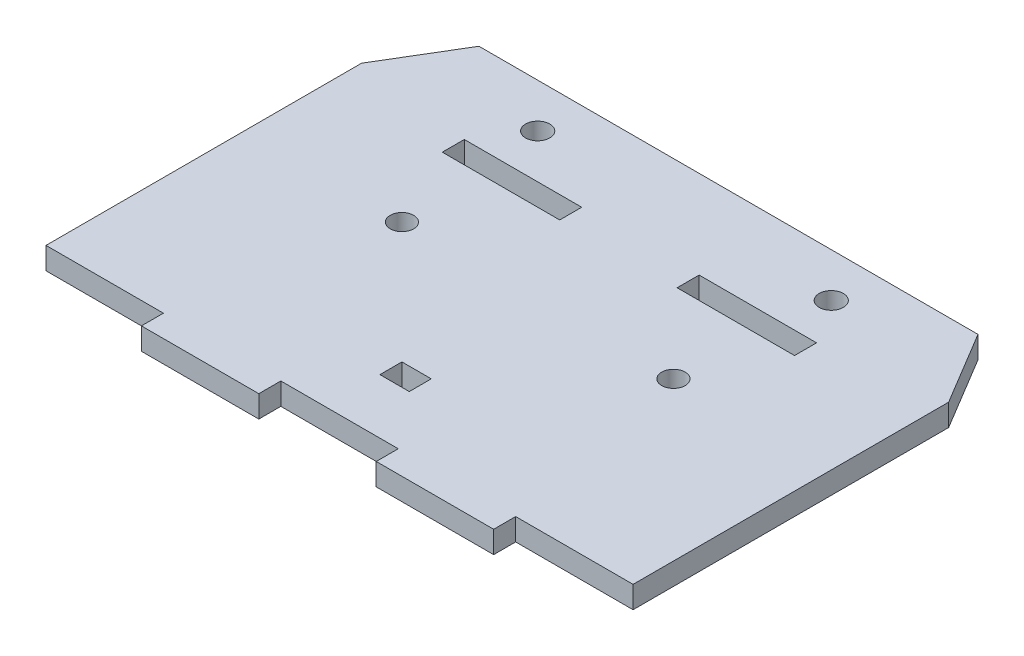
ISO-10303-21;
HEADER;
FILE_DESCRIPTION(('STEP AP214'),'2;1');
FILE_NAME('part.step','',(''),(''),'','','');
FILE_SCHEMA(('AUTOMOTIVE_DESIGN { 1 0 10303 214 1 1 1 1 }'));
ENDSEC;
DATA;
#1=APPLICATION_CONTEXT('core data for automotive mechanical design processes');
#2=APPLICATION_PROTOCOL_DEFINITION('international standard','automotive_design',2000,#1);
#3=PRODUCT_CONTEXT('',#1,'mechanical');
#4=PRODUCT('Part','Part','',(#3));
#5=PRODUCT_RELATED_PRODUCT_CATEGORY('part','',(#4));
#6=PRODUCT_DEFINITION_FORMATION('','',#4);
#7=PRODUCT_DEFINITION_CONTEXT('part definition',#1,'design');
#8=PRODUCT_DEFINITION('design','',#6,#7);
#9=PRODUCT_DEFINITION_SHAPE('','',#8);
#10=(LENGTH_UNIT() NAMED_UNIT(*) SI_UNIT(.MILLI.,.METRE.));
#11=(NAMED_UNIT(*) PLANE_ANGLE_UNIT() SI_UNIT($,.RADIAN.));
#12=(NAMED_UNIT(*) SI_UNIT($,.STERADIAN.) SOLID_ANGLE_UNIT());
#13=UNCERTAINTY_MEASURE_WITH_UNIT(LENGTH_MEASURE(1.E-05),#10,'distance_accuracy_value','');
#14=(GEOMETRIC_REPRESENTATION_CONTEXT(3) GLOBAL_UNCERTAINTY_ASSIGNED_CONTEXT((#13)) GLOBAL_UNIT_ASSIGNED_CONTEXT((#10,
#11,#12)) REPRESENTATION_CONTEXT('',''));
#15=CARTESIAN_POINT('',(0.,0.,0.));
#16=DIRECTION('',(0.,0.,1.));
#17=DIRECTION('',(1.,0.,0.));
#18=AXIS2_PLACEMENT_3D('',#15,#16,#17);
#19=CARTESIAN_POINT('',(0.,3.,0.));
#20=DIRECTION('',(0.,-1.,0.));
#21=DIRECTION('',(0.,0.,-1.));
#22=AXIS2_PLACEMENT_3D('',#19,#20,#21);
#23=PLANE('',#22);
#24=DIRECTION('',(-1.,0.,0.));
#25=VECTOR('',#24,1.);
#26=CARTESIAN_POINT('',(-2.,3.,-4.50000000000001));
#27=LINE('',#26,#25);
#28=CARTESIAN_POINT('',(2.,3.,-4.50000000000001));
#29=VERTEX_POINT('',#28);
#30=CARTESIAN_POINT('',(-2.,3.,-4.50000000000001));
#31=VERTEX_POINT('',#30);
#32=EDGE_CURVE('E236',#29,#31,#27,.T.);
#33=ORIENTED_EDGE('',*,*,#32,.F.);
#34=DIRECTION('',(0.,0.,-1.));
#35=VECTOR('',#34,1.);
#36=CARTESIAN_POINT('',(2.,3.,-4.50000000000001));
#37=LINE('',#36,#35);
#38=CARTESIAN_POINT('',(2.00000000000001,3.,-1.50000000000001));
#39=VERTEX_POINT('',#38);
#40=EDGE_CURVE('E48',#39,#29,#37,.T.);
#41=ORIENTED_EDGE('',*,*,#40,.F.);
#42=DIRECTION('',(1.,0.,0.));
#43=VECTOR('',#42,1.);
#44=CARTESIAN_POINT('',(-2.,3.,-1.50000000000001));
#45=LINE('',#44,#43);
#46=CARTESIAN_POINT('',(-2.,3.,-1.50000000000001));
#47=VERTEX_POINT('',#46);
#48=EDGE_CURVE('E227',#47,#39,#45,.T.);
#49=ORIENTED_EDGE('',*,*,#48,.F.);
#50=DIRECTION('',(0.,0.,1.));
#51=VECTOR('',#50,1.);
#52=CARTESIAN_POINT('',(-2.,3.,-4.50000000000001));
#53=LINE('',#52,#51);
#54=EDGE_CURVE('E230',#31,#47,#53,.T.);
#55=ORIENTED_EDGE('',*,*,#54,.F.);
#56=EDGE_LOOP('',(#33,#41,#49,#55));
#57=FACE_BOUND('',#56,.T.);
#58=CARTESIAN_POINT('',(-18.5,3.,-21.));
#59=DIRECTION('',(0.,1.,0.));
#60=DIRECTION('',(0.,0.,1.));
#61=AXIS2_PLACEMENT_3D('',#58,#59,#60);
#62=CIRCLE('',#61,1.6);
#63=CARTESIAN_POINT('',(-18.5,3.,-19.4));
#64=VERTEX_POINT('',#63);
#65=EDGE_CURVE('E249',#64,#64,#62,.T.);
#66=ORIENTED_EDGE('',*,*,#65,.F.);
#67=EDGE_LOOP('',(#66));
#68=FACE_BOUND('',#67,.T.);
#69=DIRECTION('',(-1.,0.,0.));
#70=VECTOR('',#69,1.);
#71=CARTESIAN_POINT('',(-8.00000000000001,3.,-35.));
#72=LINE('',#71,#70);
#73=CARTESIAN_POINT('',(-8.00000000000001,3.,-35.));
#74=VERTEX_POINT('',#73);
#75=CARTESIAN_POINT('',(-24.,3.,-35.));
#76=VERTEX_POINT('',#75);
#77=EDGE_CURVE('E268',#74,#76,#72,.T.);
#78=ORIENTED_EDGE('',*,*,#77,.F.);
#79=DIRECTION('',(0.,0.,-1.));
#80=VECTOR('',#79,1.);
#81=CARTESIAN_POINT('',(-8.00000000000001,3.,-32.));
#82=LINE('',#81,#80);
#83=CARTESIAN_POINT('',(-8.00000000000001,3.,-32.));
#84=VERTEX_POINT('',#83);
#85=EDGE_CURVE('E56',#84,#74,#82,.T.);
#86=ORIENTED_EDGE('',*,*,#85,.F.);
#87=DIRECTION('',(1.,0.,0.));
#88=VECTOR('',#87,1.);
#89=CARTESIAN_POINT('',(-24.,3.,-32.));
#90=LINE('',#89,#88);
#91=CARTESIAN_POINT('',(-24.,3.,-32.));
#92=VERTEX_POINT('',#91);
#93=EDGE_CURVE('E257',#92,#84,#90,.T.);
#94=ORIENTED_EDGE('',*,*,#93,.F.);
#95=DIRECTION('',(0.,0.,1.));
#96=VECTOR('',#95,1.);
#97=CARTESIAN_POINT('',(-24.,3.,-35.));
#98=LINE('',#97,#96);
#99=EDGE_CURVE('E272',#76,#92,#98,.T.);
#100=ORIENTED_EDGE('',*,*,#99,.F.);
#101=EDGE_LOOP('',(#78,#86,#94,#100));
#102=FACE_BOUND('',#101,.T.);
#103=CARTESIAN_POINT('',(18.5,3.,-21.));
#104=DIRECTION('',(0.,1.,0.));
#105=DIRECTION('',(0.,0.,1.));
#106=AXIS2_PLACEMENT_3D('',#103,#104,#105);
#107=CIRCLE('',#106,1.6);
#108=CARTESIAN_POINT('',(18.5,3.,-19.4));
#109=VERTEX_POINT('',#108);
#110=EDGE_CURVE('E285',#109,#109,#107,.T.);
#111=ORIENTED_EDGE('',*,*,#110,.F.);
#112=EDGE_LOOP('',(#111));
#113=FACE_BOUND('',#112,.T.);
#114=DIRECTION('',(0.,0.,-1.));
#115=VECTOR('',#114,1.);
#116=CARTESIAN_POINT('',(24.,3.,-35.));
#117=LINE('',#116,#115);
#118=CARTESIAN_POINT('',(24.,3.,-32.));
#119=VERTEX_POINT('',#118);
#120=CARTESIAN_POINT('',(24.,3.,-35.));
#121=VERTEX_POINT('',#120);
#122=EDGE_CURVE('E305',#119,#121,#117,.T.);
#123=ORIENTED_EDGE('',*,*,#122,.F.);
#124=DIRECTION('',(1.,0.,0.));
#125=VECTOR('',#124,1.);
#126=CARTESIAN_POINT('',(24.,3.,-32.));
#127=LINE('',#126,#125);
#128=CARTESIAN_POINT('',(7.99999999999999,3.,-32.));
#129=VERTEX_POINT('',#128);
#130=EDGE_CURVE('E303',#129,#119,#127,.T.);
#131=ORIENTED_EDGE('',*,*,#130,.F.);
#132=DIRECTION('',(0.,0.,1.));
#133=VECTOR('',#132,1.);
#134=CARTESIAN_POINT('',(7.99999999999999,3.,-32.));
#135=LINE('',#134,#133);
#136=CARTESIAN_POINT('',(7.99999999999999,3.,-35.));
#137=VERTEX_POINT('',#136);
#138=EDGE_CURVE('E293',#137,#129,#135,.T.);
#139=ORIENTED_EDGE('',*,*,#138,.F.);
#140=DIRECTION('',(-1.,0.,0.));
#141=VECTOR('',#140,1.);
#142=CARTESIAN_POINT('',(7.99999999999999,3.,-35.));
#143=LINE('',#142,#141);
#144=EDGE_CURVE('E308',#121,#137,#143,.T.);
#145=ORIENTED_EDGE('',*,*,#144,.F.);
#146=EDGE_LOOP('',(#123,#131,#139,#145));
#147=FACE_BOUND('',#146,.T.);
#148=DIRECTION('',(-1.,0.,0.));
#149=VECTOR('',#148,1.);
#150=CARTESIAN_POINT('',(-34.,3.,-47.));
#151=LINE('',#150,#149);
#152=CARTESIAN_POINT('',(34.,3.,-47.));
#153=VERTEX_POINT('',#152);
#154=CARTESIAN_POINT('',(-34.,3.,-47.));
#155=VERTEX_POINT('',#154);
#156=EDGE_CURVE('E332',#153,#155,#151,.T.);
#157=ORIENTED_EDGE('',*,*,#156,.T.);
#158=DIRECTION('',(-0.514495755427526,0.,0.857492925712544));
#159=VECTOR('',#158,1.);
#160=CARTESIAN_POINT('',(-40.,3.,-37.));
#161=LINE('',#160,#159);
#162=CARTESIAN_POINT('',(-40.,3.,-37.));
#163=VERTEX_POINT('',#162);
#164=EDGE_CURVE('E335',#155,#163,#161,.T.);
#165=ORIENTED_EDGE('',*,*,#164,.T.);
#166=DIRECTION('',(0.,0.,1.));
#167=VECTOR('',#166,1.);
#168=CARTESIAN_POINT('',(-40.,3.,-37.));
#169=LINE('',#168,#167);
#170=CARTESIAN_POINT('',(-40.,3.,6.));
#171=VERTEX_POINT('',#170);
#172=EDGE_CURVE('E338',#163,#171,#169,.T.);
#173=ORIENTED_EDGE('',*,*,#172,.T.);
#174=DIRECTION('',(1.,0.,0.));
#175=VECTOR('',#174,1.);
#176=CARTESIAN_POINT('',(-40.,3.,6.));
#177=LINE('',#176,#175);
#178=CARTESIAN_POINT('',(-24.,3.,6.));
#179=VERTEX_POINT('',#178);
#180=EDGE_CURVE('E340',#171,#179,#177,.T.);
#181=ORIENTED_EDGE('',*,*,#180,.T.);
#182=DIRECTION('',(0.,0.,1.));
#183=VECTOR('',#182,1.);
#184=CARTESIAN_POINT('',(-24.,3.,6.));
#185=LINE('',#184,#183);
#186=CARTESIAN_POINT('',(-24.,3.,9.));
#187=VERTEX_POINT('',#186);
#188=EDGE_CURVE('E342',#179,#187,#185,.T.);
#189=ORIENTED_EDGE('',*,*,#188,.T.);
#190=DIRECTION('',(1.,0.,0.));
#191=VECTOR('',#190,1.);
#192=CARTESIAN_POINT('',(-24.,3.,9.));
#193=LINE('',#192,#191);
#194=CARTESIAN_POINT('',(-8.,3.,8.99999999999999));
#195=VERTEX_POINT('',#194);
#196=EDGE_CURVE('E344',#187,#195,#193,.T.);
#197=ORIENTED_EDGE('',*,*,#196,.T.);
#198=DIRECTION('',(0.,0.,-1.));
#199=VECTOR('',#198,1.);
#200=CARTESIAN_POINT('',(-8.,3.,8.99999999999999));
#201=LINE('',#200,#199);
#202=CARTESIAN_POINT('',(-8.,3.,6.));
#203=VERTEX_POINT('',#202);
#204=EDGE_CURVE('E346',#195,#203,#201,.T.);
#205=ORIENTED_EDGE('',*,*,#204,.T.);
#206=DIRECTION('',(1.,0.,0.));
#207=VECTOR('',#206,1.);
#208=CARTESIAN_POINT('',(-8.,3.,6.));
#209=LINE('',#208,#207);
#210=CARTESIAN_POINT('',(8.,3.,6.));
#211=VERTEX_POINT('',#210);
#212=EDGE_CURVE('E348',#203,#211,#209,.T.);
#213=ORIENTED_EDGE('',*,*,#212,.T.);
#214=DIRECTION('',(0.,0.,1.));
#215=VECTOR('',#214,1.);
#216=CARTESIAN_POINT('',(8.,3.,6.));
#217=LINE('',#216,#215);
#218=CARTESIAN_POINT('',(8.,3.,9.));
#219=VERTEX_POINT('',#218);
#220=EDGE_CURVE('E350',#211,#219,#217,.T.);
#221=ORIENTED_EDGE('',*,*,#220,.T.);
#222=DIRECTION('',(1.,0.,0.));
#223=VECTOR('',#222,1.);
#224=CARTESIAN_POINT('',(8.,3.,9.));
#225=LINE('',#224,#223);
#226=CARTESIAN_POINT('',(24.,3.,8.99999999999999));
#227=VERTEX_POINT('',#226);
#228=EDGE_CURVE('E352',#219,#227,#225,.T.);
#229=ORIENTED_EDGE('',*,*,#228,.T.);
#230=DIRECTION('',(0.,0.,-1.));
#231=VECTOR('',#230,1.);
#232=CARTESIAN_POINT('',(24.,3.,8.99999999999999));
#233=LINE('',#232,#231);
#234=CARTESIAN_POINT('',(24.,3.,6.));
#235=VERTEX_POINT('',#234);
#236=EDGE_CURVE('E354',#227,#235,#233,.T.);
#237=ORIENTED_EDGE('',*,*,#236,.T.);
#238=DIRECTION('',(1.,0.,0.));
#239=VECTOR('',#238,1.);
#240=CARTESIAN_POINT('',(24.,3.,6.));
#241=LINE('',#240,#239);
#242=CARTESIAN_POINT('',(40.,3.,6.));
#243=VERTEX_POINT('',#242);
#244=EDGE_CURVE('E356',#235,#243,#241,.T.);
#245=ORIENTED_EDGE('',*,*,#244,.T.);
#246=DIRECTION('',(0.,0.,-1.));
#247=VECTOR('',#246,1.);
#248=CARTESIAN_POINT('',(40.,3.,-37.));
#249=LINE('',#248,#247);
#250=CARTESIAN_POINT('',(40.,3.,-37.));
#251=VERTEX_POINT('',#250);
#252=EDGE_CURVE('E358',#243,#251,#249,.T.);
#253=ORIENTED_EDGE('',*,*,#252,.T.);
#254=DIRECTION('',(-0.514495755427526,0.,-0.857492925712544));
#255=VECTOR('',#254,1.);
#256=CARTESIAN_POINT('',(34.,3.,-47.));
#257=LINE('',#256,#255);
#258=EDGE_CURVE('E360',#251,#153,#257,.T.);
#259=ORIENTED_EDGE('',*,*,#258,.T.);
#260=EDGE_LOOP('',(#157,#165,#173,#181,#189,#197,#205,#213,#221,#229,#237,#245,#253,#259));
#261=FACE_BOUND('',#260,.T.);
#262=CARTESIAN_POINT('',(-20.,3.,-41.));
#263=DIRECTION('',(0.,1.,0.));
#264=DIRECTION('',(0.,0.,1.));
#265=AXIS2_PLACEMENT_3D('',#262,#263,#264);
#266=CIRCLE('',#265,1.65);
#267=CARTESIAN_POINT('',(-20.,3.,-39.35));
#268=VERTEX_POINT('',#267);
#269=EDGE_CURVE('E326',#268,#268,#266,.T.);
#270=ORIENTED_EDGE('',*,*,#269,.F.);
#271=EDGE_LOOP('',(#270));
#272=FACE_BOUND('',#271,.T.);
#273=CARTESIAN_POINT('',(20.,3.,-41.0031036621103));
#274=DIRECTION('',(0.,1.,0.));
#275=DIRECTION('',(0.,0.,1.));
#276=AXIS2_PLACEMENT_3D('',#273,#274,#275);
#277=CIRCLE('',#276,1.65);
#278=CARTESIAN_POINT('',(20.,3.,-39.3531036621103));
#279=VERTEX_POINT('',#278);
#280=EDGE_CURVE('E320',#279,#279,#277,.T.);
#281=ORIENTED_EDGE('',*,*,#280,.F.);
#282=EDGE_LOOP('',(#281));
#283=FACE_BOUND('',#282,.T.);
#284=ADVANCED_FACE('F33',(#57,#68,#102,#113,#147,#261,#272,#283),#23,.F.);
#285=CARTESIAN_POINT('',(0.,0.,0.));
#286=DIRECTION('',(0.,-1.,0.));
#287=DIRECTION('',(0.,0.,-1.));
#288=AXIS2_PLACEMENT_3D('',#285,#286,#287);
#289=PLANE('',#288);
#290=DIRECTION('',(0.,0.,-1.));
#291=VECTOR('',#290,1.);
#292=CARTESIAN_POINT('',(2.,0.,-4.50000000000001));
#293=LINE('',#292,#291);
#294=CARTESIAN_POINT('',(2.00000000000001,0.,-1.50000000000001));
#295=VERTEX_POINT('',#294);
#296=CARTESIAN_POINT('',(2.,0.,-4.50000000000001));
#297=VERTEX_POINT('',#296);
#298=EDGE_CURVE('E208',#295,#297,#293,.T.);
#299=ORIENTED_EDGE('',*,*,#298,.T.);
#300=DIRECTION('',(-1.,0.,0.));
#301=VECTOR('',#300,1.);
#302=CARTESIAN_POINT('',(-2.,0.,-4.50000000000001));
#303=LINE('',#302,#301);
#304=CARTESIAN_POINT('',(-2.,0.,-4.50000000000001));
#305=VERTEX_POINT('',#304);
#306=EDGE_CURVE('E218',#297,#305,#303,.T.);
#307=ORIENTED_EDGE('',*,*,#306,.T.);
#308=DIRECTION('',(0.,0.,1.));
#309=VECTOR('',#308,1.);
#310=CARTESIAN_POINT('',(-2.,0.,-4.50000000000001));
#311=LINE('',#310,#309);
#312=CARTESIAN_POINT('',(-2.,0.,-1.50000000000001));
#313=VERTEX_POINT('',#312);
#314=EDGE_CURVE('E222',#305,#313,#311,.T.);
#315=ORIENTED_EDGE('',*,*,#314,.T.);
#316=DIRECTION('',(1.,0.,0.));
#317=VECTOR('',#316,1.);
#318=CARTESIAN_POINT('',(-2.,0.,-1.50000000000001));
#319=LINE('',#318,#317);
#320=EDGE_CURVE('E214',#313,#295,#319,.T.);
#321=ORIENTED_EDGE('',*,*,#320,.T.);
#322=EDGE_LOOP('',(#299,#307,#315,#321));
#323=FACE_BOUND('',#322,.T.);
#324=CARTESIAN_POINT('',(-18.5,0.,-21.));
#325=DIRECTION('',(0.,1.,0.));
#326=DIRECTION('',(0.,0.,1.));
#327=AXIS2_PLACEMENT_3D('',#324,#325,#326);
#328=CIRCLE('',#327,1.6);
#329=CARTESIAN_POINT('',(-18.5,0.,-19.4));
#330=VERTEX_POINT('',#329);
#331=EDGE_CURVE('E237',#330,#330,#328,.T.);
#332=ORIENTED_EDGE('',*,*,#331,.T.);
#333=EDGE_LOOP('',(#332));
#334=FACE_BOUND('',#333,.T.);
#335=DIRECTION('',(0.,0.,-1.));
#336=VECTOR('',#335,1.);
#337=CARTESIAN_POINT('',(-8.00000000000001,0.,-32.));
#338=LINE('',#337,#336);
#339=CARTESIAN_POINT('',(-8.00000000000001,0.,-32.));
#340=VERTEX_POINT('',#339);
#341=CARTESIAN_POINT('',(-8.00000000000001,0.,-35.));
#342=VERTEX_POINT('',#341);
#343=EDGE_CURVE('E253',#340,#342,#338,.T.);
#344=ORIENTED_EDGE('',*,*,#343,.T.);
#345=DIRECTION('',(-1.,0.,0.));
#346=VECTOR('',#345,1.);
#347=CARTESIAN_POINT('',(-8.00000000000001,0.,-35.));
#348=LINE('',#347,#346);
#349=CARTESIAN_POINT('',(-24.,0.,-35.));
#350=VERTEX_POINT('',#349);
#351=EDGE_CURVE('E256',#342,#350,#348,.T.);
#352=ORIENTED_EDGE('',*,*,#351,.T.);
#353=DIRECTION('',(0.,0.,1.));
#354=VECTOR('',#353,1.);
#355=CARTESIAN_POINT('',(-24.,0.,-35.));
#356=LINE('',#355,#354);
#357=CARTESIAN_POINT('',(-24.,0.,-32.));
#358=VERTEX_POINT('',#357);
#359=EDGE_CURVE('E260',#350,#358,#356,.T.);
#360=ORIENTED_EDGE('',*,*,#359,.T.);
#361=DIRECTION('',(1.,0.,0.));
#362=VECTOR('',#361,1.);
#363=CARTESIAN_POINT('',(-24.,0.,-32.));
#364=LINE('',#363,#362);
#365=EDGE_CURVE('E263',#358,#340,#364,.T.);
#366=ORIENTED_EDGE('',*,*,#365,.T.);
#367=EDGE_LOOP('',(#344,#352,#360,#366));
#368=FACE_BOUND('',#367,.T.);
#369=CARTESIAN_POINT('',(18.5,0.,-21.));
#370=DIRECTION('',(0.,1.,0.));
#371=DIRECTION('',(0.,0.,1.));
#372=AXIS2_PLACEMENT_3D('',#369,#370,#371);
#373=CIRCLE('',#372,1.6);
#374=CARTESIAN_POINT('',(18.5,0.,-19.4));
#375=VERTEX_POINT('',#374);
#376=EDGE_CURVE('E269',#375,#375,#373,.T.);
#377=ORIENTED_EDGE('',*,*,#376,.T.);
#378=EDGE_LOOP('',(#377));
#379=FACE_BOUND('',#378,.T.);
#380=DIRECTION('',(1.,0.,0.));
#381=VECTOR('',#380,1.);
#382=CARTESIAN_POINT('',(24.,0.,-32.));
#383=LINE('',#382,#381);
#384=CARTESIAN_POINT('',(7.99999999999999,0.,-32.));
#385=VERTEX_POINT('',#384);
#386=CARTESIAN_POINT('',(24.,0.,-32.));
#387=VERTEX_POINT('',#386);
#388=EDGE_CURVE('E289',#385,#387,#383,.T.);
#389=ORIENTED_EDGE('',*,*,#388,.T.);
#390=DIRECTION('',(0.,0.,-1.));
#391=VECTOR('',#390,1.);
#392=CARTESIAN_POINT('',(24.,0.,-35.));
#393=LINE('',#392,#391);
#394=CARTESIAN_POINT('',(24.,0.,-35.));
#395=VERTEX_POINT('',#394);
#396=EDGE_CURVE('E292',#387,#395,#393,.T.);
#397=ORIENTED_EDGE('',*,*,#396,.T.);
#398=DIRECTION('',(-1.,0.,0.));
#399=VECTOR('',#398,1.);
#400=CARTESIAN_POINT('',(7.99999999999999,0.,-35.));
#401=LINE('',#400,#399);
#402=CARTESIAN_POINT('',(7.99999999999999,0.,-35.));
#403=VERTEX_POINT('',#402);
#404=EDGE_CURVE('E296',#395,#403,#401,.T.);
#405=ORIENTED_EDGE('',*,*,#404,.T.);
#406=DIRECTION('',(0.,0.,1.));
#407=VECTOR('',#406,1.);
#408=CARTESIAN_POINT('',(7.99999999999999,0.,-32.));
#409=LINE('',#408,#407);
#410=EDGE_CURVE('E299',#403,#385,#409,.T.);
#411=ORIENTED_EDGE('',*,*,#410,.T.);
#412=EDGE_LOOP('',(#389,#397,#405,#411));
#413=FACE_BOUND('',#412,.T.);
#414=CARTESIAN_POINT('',(-20.,0.,-41.));
#415=DIRECTION('',(0.,1.,0.));
#416=DIRECTION('',(0.,0.,1.));
#417=AXIS2_PLACEMENT_3D('',#414,#415,#416);
#418=CIRCLE('',#417,1.65);
#419=CARTESIAN_POINT('',(-20.,0.,-39.35));
#420=VERTEX_POINT('',#419);
#421=EDGE_CURVE('E323',#420,#420,#418,.T.);
#422=ORIENTED_EDGE('',*,*,#421,.T.);
#423=EDGE_LOOP('',(#422));
#424=FACE_BOUND('',#423,.T.);
#425=DIRECTION('',(-1.,0.,0.));
#426=VECTOR('',#425,1.);
#427=CARTESIAN_POINT('',(-34.,0.,-47.));
#428=LINE('',#427,#426);
#429=CARTESIAN_POINT('',(34.,0.,-47.));
#430=VERTEX_POINT('',#429);
#431=CARTESIAN_POINT('',(-34.,0.,-47.));
#432=VERTEX_POINT('',#431);
#433=EDGE_CURVE('E329',#430,#432,#428,.T.);
#434=ORIENTED_EDGE('',*,*,#433,.F.);
#435=DIRECTION('',(-0.514495755427526,0.,-0.857492925712544));
#436=VECTOR('',#435,1.);
#437=CARTESIAN_POINT('',(34.,0.,-47.));
#438=LINE('',#437,#436);
#439=CARTESIAN_POINT('',(40.,0.,-37.));
#440=VERTEX_POINT('',#439);
#441=EDGE_CURVE('E336',#440,#430,#438,.T.);
#442=ORIENTED_EDGE('',*,*,#441,.F.);
#443=DIRECTION('',(0.,0.,-1.));
#444=VECTOR('',#443,1.);
#445=CARTESIAN_POINT('',(40.,0.,-37.));
#446=LINE('',#445,#444);
#447=CARTESIAN_POINT('',(40.,0.,6.));
#448=VERTEX_POINT('',#447);
#449=EDGE_CURVE('E387',#448,#440,#446,.T.);
#450=ORIENTED_EDGE('',*,*,#449,.F.);
#451=DIRECTION('',(1.,0.,0.));
#452=VECTOR('',#451,1.);
#453=CARTESIAN_POINT('',(24.,0.,6.));
#454=LINE('',#453,#452);
#455=CARTESIAN_POINT('',(24.,0.,6.));
#456=VERTEX_POINT('',#455);
#457=EDGE_CURVE('E385',#456,#448,#454,.T.);
#458=ORIENTED_EDGE('',*,*,#457,.F.);
#459=DIRECTION('',(0.,0.,-1.));
#460=VECTOR('',#459,1.);
#461=CARTESIAN_POINT('',(24.,0.,8.99999999999999));
#462=LINE('',#461,#460);
#463=CARTESIAN_POINT('',(24.,0.,8.99999999999999));
#464=VERTEX_POINT('',#463);
#465=EDGE_CURVE('E383',#464,#456,#462,.T.);
#466=ORIENTED_EDGE('',*,*,#465,.F.);
#467=DIRECTION('',(1.,0.,0.));
#468=VECTOR('',#467,1.);
#469=CARTESIAN_POINT('',(8.,0.,9.));
#470=LINE('',#469,#468);
#471=CARTESIAN_POINT('',(8.,0.,9.));
#472=VERTEX_POINT('',#471);
#473=EDGE_CURVE('E381',#472,#464,#470,.T.);
#474=ORIENTED_EDGE('',*,*,#473,.F.);
#475=DIRECTION('',(0.,0.,1.));
#476=VECTOR('',#475,1.);
#477=CARTESIAN_POINT('',(8.,0.,6.));
#478=LINE('',#477,#476);
#479=CARTESIAN_POINT('',(8.,0.,6.));
#480=VERTEX_POINT('',#479);
#481=EDGE_CURVE('E379',#480,#472,#478,.T.);
#482=ORIENTED_EDGE('',*,*,#481,.F.);
#483=DIRECTION('',(1.,0.,0.));
#484=VECTOR('',#483,1.);
#485=CARTESIAN_POINT('',(-8.,0.,6.));
#486=LINE('',#485,#484);
#487=CARTESIAN_POINT('',(-8.,0.,6.));
#488=VERTEX_POINT('',#487);
#489=EDGE_CURVE('E377',#488,#480,#486,.T.);
#490=ORIENTED_EDGE('',*,*,#489,.F.);
#491=DIRECTION('',(0.,0.,-1.));
#492=VECTOR('',#491,1.);
#493=CARTESIAN_POINT('',(-8.,0.,8.99999999999999));
#494=LINE('',#493,#492);
#495=CARTESIAN_POINT('',(-8.,0.,8.99999999999999));
#496=VERTEX_POINT('',#495);
#497=EDGE_CURVE('E375',#496,#488,#494,.T.);
#498=ORIENTED_EDGE('',*,*,#497,.F.);
#499=DIRECTION('',(1.,0.,0.));
#500=VECTOR('',#499,1.);
#501=CARTESIAN_POINT('',(-24.,0.,9.));
#502=LINE('',#501,#500);
#503=CARTESIAN_POINT('',(-24.,0.,9.));
#504=VERTEX_POINT('',#503);
#505=EDGE_CURVE('E373',#504,#496,#502,.T.);
#506=ORIENTED_EDGE('',*,*,#505,.F.);
#507=DIRECTION('',(0.,0.,1.));
#508=VECTOR('',#507,1.);
#509=CARTESIAN_POINT('',(-24.,0.,6.));
#510=LINE('',#509,#508);
#511=CARTESIAN_POINT('',(-24.,0.,6.));
#512=VERTEX_POINT('',#511);
#513=EDGE_CURVE('E371',#512,#504,#510,.T.);
#514=ORIENTED_EDGE('',*,*,#513,.F.);
#515=DIRECTION('',(1.,0.,0.));
#516=VECTOR('',#515,1.);
#517=CARTESIAN_POINT('',(-40.,0.,6.));
#518=LINE('',#517,#516);
#519=CARTESIAN_POINT('',(-40.,0.,6.));
#520=VERTEX_POINT('',#519);
#521=EDGE_CURVE('E369',#520,#512,#518,.T.);
#522=ORIENTED_EDGE('',*,*,#521,.F.);
#523=DIRECTION('',(0.,0.,1.));
#524=VECTOR('',#523,1.);
#525=CARTESIAN_POINT('',(-40.,0.,-37.));
#526=LINE('',#525,#524);
#527=CARTESIAN_POINT('',(-40.,0.,-37.));
#528=VERTEX_POINT('',#527);
#529=EDGE_CURVE('E367',#528,#520,#526,.T.);
#530=ORIENTED_EDGE('',*,*,#529,.F.);
#531=DIRECTION('',(-0.514495755427526,0.,0.857492925712544));
#532=VECTOR('',#531,1.);
#533=CARTESIAN_POINT('',(-40.,0.,-37.));
#534=LINE('',#533,#532);
#535=EDGE_CURVE('E365',#432,#528,#534,.T.);
#536=ORIENTED_EDGE('',*,*,#535,.F.);
#537=EDGE_LOOP('',(#434,#442,#450,#458,#466,#474,#482,#490,#498,#506,#514,#522,#530,#536));
#538=FACE_BOUND('',#537,.T.);
#539=CARTESIAN_POINT('',(20.,0.,-41.0031036621103));
#540=DIRECTION('',(0.,1.,0.));
#541=DIRECTION('',(0.,0.,1.));
#542=AXIS2_PLACEMENT_3D('',#539,#540,#541);
#543=CIRCLE('',#542,1.65);
#544=CARTESIAN_POINT('',(20.,0.,-39.3531036621103));
#545=VERTEX_POINT('',#544);
#546=EDGE_CURVE('E243',#545,#545,#543,.T.);
#547=ORIENTED_EDGE('',*,*,#546,.T.);
#548=EDGE_LOOP('',(#547));
#549=FACE_BOUND('',#548,.T.);
#550=ADVANCED_FACE('F224',(#323,#334,#368,#379,#413,#424,#538,#549),#289,.T.);
#551=CARTESIAN_POINT('',(-34.,3.,-47.));
#552=DIRECTION('',(0.,0.,1.));
#553=DIRECTION('',(1.,0.,0.));
#554=AXIS2_PLACEMENT_3D('',#551,#552,#553);
#555=PLANE('',#554);
#556=ORIENTED_EDGE('',*,*,#433,.T.);
#557=DIRECTION('',(0.,-1.,0.));
#558=VECTOR('',#557,1.);
#559=CARTESIAN_POINT('',(-34.,3.,-47.));
#560=LINE('',#559,#558);
#561=EDGE_CURVE('E11',#155,#432,#560,.T.);
#562=ORIENTED_EDGE('',*,*,#561,.F.);
#563=ORIENTED_EDGE('',*,*,#156,.F.);
#564=DIRECTION('',(0.,-1.,0.));
#565=VECTOR('',#564,1.);
#566=CARTESIAN_POINT('',(34.,3.,-47.));
#567=LINE('',#566,#565);
#568=EDGE_CURVE('E362',#153,#430,#567,.T.);
#569=ORIENTED_EDGE('',*,*,#568,.T.);
#570=EDGE_LOOP('',(#556,#562,#563,#569));
#571=FACE_BOUND('',#570,.T.);
#572=ADVANCED_FACE('F35',(#571),#555,.F.);
#573=CARTESIAN_POINT('',(-40.,3.,-37.));
#574=DIRECTION('',(0.857492925712545,0.,0.514495755427526));
#575=DIRECTION('',(0.514495755427526,0.,-0.857492925712545));
#576=AXIS2_PLACEMENT_3D('',#573,#574,#575);
#577=PLANE('',#576);
#578=ORIENTED_EDGE('',*,*,#535,.T.);
#579=DIRECTION('',(0.,-1.,0.));
#580=VECTOR('',#579,1.);
#581=CARTESIAN_POINT('',(-40.,3.,-37.));
#582=LINE('',#581,#580);
#583=EDGE_CURVE('E41',#163,#528,#582,.T.);
#584=ORIENTED_EDGE('',*,*,#583,.F.);
#585=ORIENTED_EDGE('',*,*,#164,.F.);
#586=ORIENTED_EDGE('',*,*,#561,.T.);
#587=EDGE_LOOP('',(#578,#584,#585,#586));
#588=FACE_BOUND('',#587,.T.);
#589=ADVANCED_FACE('F452',(#588),#577,.F.);
#590=CARTESIAN_POINT('',(-40.,3.,-37.));
#591=DIRECTION('',(1.,0.,0.));
#592=DIRECTION('',(0.,0.,-1.));
#593=AXIS2_PLACEMENT_3D('',#590,#591,#592);
#594=PLANE('',#593);
#595=ORIENTED_EDGE('',*,*,#529,.T.);
#596=DIRECTION('',(0.,-1.,0.));
#597=VECTOR('',#596,1.);
#598=CARTESIAN_POINT('',(-40.,3.,6.));
#599=LINE('',#598,#597);
#600=EDGE_CURVE('E422',#171,#520,#599,.T.);
#601=ORIENTED_EDGE('',*,*,#600,.F.);
#602=ORIENTED_EDGE('',*,*,#172,.F.);
#603=ORIENTED_EDGE('',*,*,#583,.T.);
#604=EDGE_LOOP('',(#595,#601,#602,#603));
#605=FACE_BOUND('',#604,.T.);
#606=ADVANCED_FACE('F429',(#605),#594,.F.);
#607=CARTESIAN_POINT('',(-40.,3.,6.));
#608=DIRECTION('',(0.,0.,-1.));
#609=DIRECTION('',(-1.,0.,0.));
#610=AXIS2_PLACEMENT_3D('',#607,#608,#609);
#611=PLANE('',#610);
#612=ORIENTED_EDGE('',*,*,#521,.T.);
#613=DIRECTION('',(0.,-1.,0.));
#614=VECTOR('',#613,1.);
#615=CARTESIAN_POINT('',(-24.,3.,6.));
#616=LINE('',#615,#614);
#617=EDGE_CURVE('E419',#179,#512,#616,.T.);
#618=ORIENTED_EDGE('',*,*,#617,.F.);
#619=ORIENTED_EDGE('',*,*,#180,.F.);
#620=ORIENTED_EDGE('',*,*,#600,.T.);
#621=EDGE_LOOP('',(#612,#618,#619,#620));
#622=FACE_BOUND('',#621,.T.);
#623=ADVANCED_FACE('F440',(#622),#611,.F.);
#624=CARTESIAN_POINT('',(-24.,3.,6.));
#625=DIRECTION('',(1.,0.,0.));
#626=DIRECTION('',(0.,0.,-1.));
#627=AXIS2_PLACEMENT_3D('',#624,#625,#626);
#628=PLANE('',#627);
#629=ORIENTED_EDGE('',*,*,#513,.T.);
#630=DIRECTION('',(0.,-1.,0.));
#631=VECTOR('',#630,1.);
#632=CARTESIAN_POINT('',(-24.,3.,9.));
#633=LINE('',#632,#631);
#634=EDGE_CURVE('E416',#187,#504,#633,.T.);
#635=ORIENTED_EDGE('',*,*,#634,.F.);
#636=ORIENTED_EDGE('',*,*,#188,.F.);
#637=ORIENTED_EDGE('',*,*,#617,.T.);
#638=EDGE_LOOP('',(#629,#635,#636,#637));
#639=FACE_BOUND('',#638,.T.);
#640=ADVANCED_FACE('F444',(#639),#628,.F.);
#641=CARTESIAN_POINT('',(-24.,3.,9.));
#642=DIRECTION('',(0.,0.,-1.));
#643=DIRECTION('',(-1.,0.,0.));
#644=AXIS2_PLACEMENT_3D('',#641,#642,#643);
#645=PLANE('',#644);
#646=ORIENTED_EDGE('',*,*,#505,.T.);
#647=DIRECTION('',(0.,-1.,0.));
#648=VECTOR('',#647,1.);
#649=CARTESIAN_POINT('',(-8.,3.,8.99999999999999));
#650=LINE('',#649,#648);
#651=EDGE_CURVE('E413',#195,#496,#650,.T.);
#652=ORIENTED_EDGE('',*,*,#651,.F.);
#653=ORIENTED_EDGE('',*,*,#196,.F.);
#654=ORIENTED_EDGE('',*,*,#634,.T.);
#655=EDGE_LOOP('',(#646,#652,#653,#654));
#656=FACE_BOUND('',#655,.T.);
#657=ADVANCED_FACE('F495',(#656),#645,.F.);
#658=CARTESIAN_POINT('',(-8.,3.,8.99999999999999));
#659=DIRECTION('',(-1.,0.,0.));
#660=DIRECTION('',(0.,0.,1.));
#661=AXIS2_PLACEMENT_3D('',#658,#659,#660);
#662=PLANE('',#661);
#663=ORIENTED_EDGE('',*,*,#497,.T.);
#664=DIRECTION('',(0.,-1.,0.));
#665=VECTOR('',#664,1.);
#666=CARTESIAN_POINT('',(-8.,3.,6.));
#667=LINE('',#666,#665);
#668=EDGE_CURVE('E410',#203,#488,#667,.T.);
#669=ORIENTED_EDGE('',*,*,#668,.F.);
#670=ORIENTED_EDGE('',*,*,#204,.F.);
#671=ORIENTED_EDGE('',*,*,#651,.T.);
#672=EDGE_LOOP('',(#663,#669,#670,#671));
#673=FACE_BOUND('',#672,.T.);
#674=ADVANCED_FACE('F493',(#673),#662,.F.);
#675=CARTESIAN_POINT('',(-8.,3.,6.));
#676=DIRECTION('',(0.,0.,-1.));
#677=DIRECTION('',(-1.,0.,0.));
#678=AXIS2_PLACEMENT_3D('',#675,#676,#677);
#679=PLANE('',#678);
#680=ORIENTED_EDGE('',*,*,#489,.T.);
#681=DIRECTION('',(0.,-1.,0.));
#682=VECTOR('',#681,1.);
#683=CARTESIAN_POINT('',(8.,3.,6.));
#684=LINE('',#683,#682);
#685=EDGE_CURVE('E407',#211,#480,#684,.T.);
#686=ORIENTED_EDGE('',*,*,#685,.F.);
#687=ORIENTED_EDGE('',*,*,#212,.F.);
#688=ORIENTED_EDGE('',*,*,#668,.T.);
#689=EDGE_LOOP('',(#680,#686,#687,#688));
#690=FACE_BOUND('',#689,.T.);
#691=ADVANCED_FACE('F488',(#690),#679,.F.);
#692=CARTESIAN_POINT('',(8.,3.,6.));
#693=DIRECTION('',(1.,0.,0.));
#694=DIRECTION('',(0.,0.,-1.));
#695=AXIS2_PLACEMENT_3D('',#692,#693,#694);
#696=PLANE('',#695);
#697=ORIENTED_EDGE('',*,*,#481,.T.);
#698=DIRECTION('',(0.,-1.,0.));
#699=VECTOR('',#698,1.);
#700=CARTESIAN_POINT('',(8.,3.,9.));
#701=LINE('',#700,#699);
#702=EDGE_CURVE('E404',#219,#472,#701,.T.);
#703=ORIENTED_EDGE('',*,*,#702,.F.);
#704=ORIENTED_EDGE('',*,*,#220,.F.);
#705=ORIENTED_EDGE('',*,*,#685,.T.);
#706=EDGE_LOOP('',(#697,#703,#704,#705));
#707=FACE_BOUND('',#706,.T.);
#708=ADVANCED_FACE('F483',(#707),#696,.F.);
#709=CARTESIAN_POINT('',(8.,3.,9.));
#710=DIRECTION('',(0.,0.,-1.));
#711=DIRECTION('',(-1.,0.,0.));
#712=AXIS2_PLACEMENT_3D('',#709,#710,#711);
#713=PLANE('',#712);
#714=ORIENTED_EDGE('',*,*,#473,.T.);
#715=DIRECTION('',(0.,-1.,0.));
#716=VECTOR('',#715,1.);
#717=CARTESIAN_POINT('',(24.,3.,8.99999999999999));
#718=LINE('',#717,#716);
#719=EDGE_CURVE('E401',#227,#464,#718,.T.);
#720=ORIENTED_EDGE('',*,*,#719,.F.);
#721=ORIENTED_EDGE('',*,*,#228,.F.);
#722=ORIENTED_EDGE('',*,*,#702,.T.);
#723=EDGE_LOOP('',(#714,#720,#721,#722));
#724=FACE_BOUND('',#723,.T.);
#725=ADVANCED_FACE('F479',(#724),#713,.F.);
#726=CARTESIAN_POINT('',(24.,3.,8.99999999999999));
#727=DIRECTION('',(-1.,0.,0.));
#728=DIRECTION('',(0.,0.,1.));
#729=AXIS2_PLACEMENT_3D('',#726,#727,#728);
#730=PLANE('',#729);
#731=ORIENTED_EDGE('',*,*,#465,.T.);
#732=DIRECTION('',(0.,-1.,0.));
#733=VECTOR('',#732,1.);
#734=CARTESIAN_POINT('',(24.,3.,6.));
#735=LINE('',#734,#733);
#736=EDGE_CURVE('E398',#235,#456,#735,.T.);
#737=ORIENTED_EDGE('',*,*,#736,.F.);
#738=ORIENTED_EDGE('',*,*,#236,.F.);
#739=ORIENTED_EDGE('',*,*,#719,.T.);
#740=EDGE_LOOP('',(#731,#737,#738,#739));
#741=FACE_BOUND('',#740,.T.);
#742=ADVANCED_FACE('F474',(#741),#730,.F.);
#743=CARTESIAN_POINT('',(24.,3.,6.));
#744=DIRECTION('',(0.,0.,-1.));
#745=DIRECTION('',(-1.,0.,0.));
#746=AXIS2_PLACEMENT_3D('',#743,#744,#745);
#747=PLANE('',#746);
#748=ORIENTED_EDGE('',*,*,#457,.T.);
#749=DIRECTION('',(0.,-1.,0.));
#750=VECTOR('',#749,1.);
#751=CARTESIAN_POINT('',(40.,3.,6.));
#752=LINE('',#751,#750);
#753=EDGE_CURVE('E395',#243,#448,#752,.T.);
#754=ORIENTED_EDGE('',*,*,#753,.F.);
#755=ORIENTED_EDGE('',*,*,#244,.F.);
#756=ORIENTED_EDGE('',*,*,#736,.T.);
#757=EDGE_LOOP('',(#748,#754,#755,#756));
#758=FACE_BOUND('',#757,.T.);
#759=ADVANCED_FACE('F468',(#758),#747,.F.);
#760=CARTESIAN_POINT('',(40.,3.,-37.));
#761=DIRECTION('',(-1.,0.,0.));
#762=DIRECTION('',(0.,0.,1.));
#763=AXIS2_PLACEMENT_3D('',#760,#761,#762);
#764=PLANE('',#763);
#765=ORIENTED_EDGE('',*,*,#449,.T.);
#766=DIRECTION('',(0.,-1.,0.));
#767=VECTOR('',#766,1.);
#768=CARTESIAN_POINT('',(40.,3.,-37.));
#769=LINE('',#768,#767);
#770=EDGE_CURVE('E392',#251,#440,#769,.T.);
#771=ORIENTED_EDGE('',*,*,#770,.F.);
#772=ORIENTED_EDGE('',*,*,#252,.F.);
#773=ORIENTED_EDGE('',*,*,#753,.T.);
#774=EDGE_LOOP('',(#765,#771,#772,#773));
#775=FACE_BOUND('',#774,.T.);
#776=ADVANCED_FACE('F464',(#775),#764,.F.);
#777=CARTESIAN_POINT('',(34.,3.,-47.));
#778=DIRECTION('',(-0.857492925712545,0.,0.514495755427526));
#779=DIRECTION('',(0.514495755427526,0.,0.857492925712545));
#780=AXIS2_PLACEMENT_3D('',#777,#778,#779);
#781=PLANE('',#780);
#782=ORIENTED_EDGE('',*,*,#441,.T.);
#783=ORIENTED_EDGE('',*,*,#568,.F.);
#784=ORIENTED_EDGE('',*,*,#258,.F.);
#785=ORIENTED_EDGE('',*,*,#770,.T.);
#786=EDGE_LOOP('',(#782,#783,#784,#785));
#787=FACE_BOUND('',#786,.T.);
#788=ADVANCED_FACE('F459',(#787),#781,.F.);
#789=CARTESIAN_POINT('',(-20.,3.,-41.));
#790=DIRECTION('',(0.,-1.,0.));
#791=DIRECTION('',(0.,0.,-1.));
#792=AXIS2_PLACEMENT_3D('',#789,#790,#791);
#793=CYLINDRICAL_SURFACE('',#792,1.65);
#794=ORIENTED_EDGE('',*,*,#269,.T.);
#795=EDGE_LOOP('',(#794));
#796=FACE_BOUND('',#795,.T.);
#797=ORIENTED_EDGE('',*,*,#421,.F.);
#798=EDGE_LOOP('',(#797));
#799=FACE_BOUND('',#798,.T.);
#800=ADVANCED_FACE('F513',(#796,#799),#793,.F.);
#801=CARTESIAN_POINT('',(20.,3.,-41.0031036621103));
#802=DIRECTION('',(0.,-1.,0.));
#803=DIRECTION('',(0.,0.,-1.));
#804=AXIS2_PLACEMENT_3D('',#801,#802,#803);
#805=CYLINDRICAL_SURFACE('',#804,1.65);
#806=ORIENTED_EDGE('',*,*,#280,.T.);
#807=EDGE_LOOP('',(#806));
#808=FACE_BOUND('',#807,.T.);
#809=ORIENTED_EDGE('',*,*,#546,.F.);
#810=EDGE_LOOP('',(#809));
#811=FACE_BOUND('',#810,.T.);
#812=ADVANCED_FACE('F563',(#808,#811),#805,.F.);
#813=CARTESIAN_POINT('',(24.,0.,-32.));
#814=DIRECTION('',(0.,0.,1.));
#815=DIRECTION('',(1.,0.,0.));
#816=AXIS2_PLACEMENT_3D('',#813,#814,#815);
#817=PLANE('',#816);
#818=ORIENTED_EDGE('',*,*,#130,.T.);
#819=DIRECTION('',(0.,1.,0.));
#820=VECTOR('',#819,1.);
#821=CARTESIAN_POINT('',(24.,0.,-32.));
#822=LINE('',#821,#820);
#823=EDGE_CURVE('E302',#387,#119,#822,.T.);
#824=ORIENTED_EDGE('',*,*,#823,.F.);
#825=ORIENTED_EDGE('',*,*,#388,.F.);
#826=DIRECTION('',(0.,1.,0.));
#827=VECTOR('',#826,1.);
#828=CARTESIAN_POINT('',(7.99999999999999,0.,-32.));
#829=LINE('',#828,#827);
#830=EDGE_CURVE('E288',#385,#129,#829,.T.);
#831=ORIENTED_EDGE('',*,*,#830,.T.);
#832=EDGE_LOOP('',(#818,#824,#825,#831));
#833=FACE_BOUND('',#832,.T.);
#834=ADVANCED_FACE('F570',(#833),#817,.F.);
#835=CARTESIAN_POINT('',(7.99999999999999,0.,-32.));
#836=DIRECTION('',(-1.,0.,0.));
#837=DIRECTION('',(0.,0.,1.));
#838=AXIS2_PLACEMENT_3D('',#835,#836,#837);
#839=PLANE('',#838);
#840=ORIENTED_EDGE('',*,*,#138,.T.);
#841=ORIENTED_EDGE('',*,*,#830,.F.);
#842=ORIENTED_EDGE('',*,*,#410,.F.);
#843=DIRECTION('',(0.,1.,0.));
#844=VECTOR('',#843,1.);
#845=CARTESIAN_POINT('',(7.99999999999999,0.,-35.));
#846=LINE('',#845,#844);
#847=EDGE_CURVE('E314',#403,#137,#846,.T.);
#848=ORIENTED_EDGE('',*,*,#847,.T.);
#849=EDGE_LOOP('',(#840,#841,#842,#848));
#850=FACE_BOUND('',#849,.T.);
#851=ADVANCED_FACE('F577',(#850),#839,.F.);
#852=CARTESIAN_POINT('',(7.99999999999999,0.,-35.));
#853=DIRECTION('',(0.,0.,-1.));
#854=DIRECTION('',(-1.,0.,0.));
#855=AXIS2_PLACEMENT_3D('',#852,#853,#854);
#856=PLANE('',#855);
#857=ORIENTED_EDGE('',*,*,#144,.T.);
#858=ORIENTED_EDGE('',*,*,#847,.F.);
#859=ORIENTED_EDGE('',*,*,#404,.F.);
#860=DIRECTION('',(0.,1.,0.));
#861=VECTOR('',#860,1.);
#862=CARTESIAN_POINT('',(24.,0.,-35.));
#863=LINE('',#862,#861);
#864=EDGE_CURVE('E316',#395,#121,#863,.T.);
#865=ORIENTED_EDGE('',*,*,#864,.T.);
#866=EDGE_LOOP('',(#857,#858,#859,#865));
#867=FACE_BOUND('',#866,.T.);
#868=ADVANCED_FACE('F586',(#867),#856,.F.);
#869=CARTESIAN_POINT('',(24.,0.,-35.));
#870=DIRECTION('',(1.,0.,0.));
#871=DIRECTION('',(0.,0.,-1.));
#872=AXIS2_PLACEMENT_3D('',#869,#870,#871);
#873=PLANE('',#872);
#874=ORIENTED_EDGE('',*,*,#122,.T.);
#875=ORIENTED_EDGE('',*,*,#864,.F.);
#876=ORIENTED_EDGE('',*,*,#396,.F.);
#877=ORIENTED_EDGE('',*,*,#823,.T.);
#878=EDGE_LOOP('',(#874,#875,#876,#877));
#879=FACE_BOUND('',#878,.T.);
#880=ADVANCED_FACE('F594',(#879),#873,.F.);
#881=CARTESIAN_POINT('',(18.5,0.,-21.));
#882=DIRECTION('',(0.,1.,0.));
#883=DIRECTION('',(0.,0.,1.));
#884=AXIS2_PLACEMENT_3D('',#881,#882,#883);
#885=CYLINDRICAL_SURFACE('',#884,1.6);
#886=ORIENTED_EDGE('',*,*,#376,.F.);
#887=EDGE_LOOP('',(#886));
#888=FACE_BOUND('',#887,.T.);
#889=ORIENTED_EDGE('',*,*,#110,.T.);
#890=EDGE_LOOP('',(#889));
#891=FACE_BOUND('',#890,.T.);
#892=ADVANCED_FACE('F602',(#888,#891),#885,.F.);
#893=CARTESIAN_POINT('',(-8.00000000000001,0.,-32.));
#894=DIRECTION('',(1.,0.,0.));
#895=DIRECTION('',(0.,0.,-1.));
#896=AXIS2_PLACEMENT_3D('',#893,#894,#895);
#897=PLANE('',#896);
#898=ORIENTED_EDGE('',*,*,#85,.T.);
#899=DIRECTION('',(0.,1.,0.));
#900=VECTOR('',#899,1.);
#901=CARTESIAN_POINT('',(-8.00000000000001,0.,-35.));
#902=LINE('',#901,#900);
#903=EDGE_CURVE('E266',#342,#74,#902,.T.);
#904=ORIENTED_EDGE('',*,*,#903,.F.);
#905=ORIENTED_EDGE('',*,*,#343,.F.);
#906=DIRECTION('',(0.,1.,0.));
#907=VECTOR('',#906,1.);
#908=CARTESIAN_POINT('',(-8.00000000000001,0.,-32.));
#909=LINE('',#908,#907);
#910=EDGE_CURVE('E252',#340,#84,#909,.T.);
#911=ORIENTED_EDGE('',*,*,#910,.T.);
#912=EDGE_LOOP('',(#898,#904,#905,#911));
#913=FACE_BOUND('',#912,.T.);
#914=ADVANCED_FACE('F610',(#913),#897,.F.);
#915=CARTESIAN_POINT('',(-24.,0.,-32.));
#916=DIRECTION('',(0.,0.,1.));
#917=DIRECTION('',(1.,0.,0.));
#918=AXIS2_PLACEMENT_3D('',#915,#916,#917);
#919=PLANE('',#918);
#920=ORIENTED_EDGE('',*,*,#93,.T.);
#921=ORIENTED_EDGE('',*,*,#910,.F.);
#922=ORIENTED_EDGE('',*,*,#365,.F.);
#923=DIRECTION('',(0.,1.,0.));
#924=VECTOR('',#923,1.);
#925=CARTESIAN_POINT('',(-24.,0.,-32.));
#926=LINE('',#925,#924);
#927=EDGE_CURVE('E278',#358,#92,#926,.T.);
#928=ORIENTED_EDGE('',*,*,#927,.T.);
#929=EDGE_LOOP('',(#920,#921,#922,#928));
#930=FACE_BOUND('',#929,.T.);
#931=ADVANCED_FACE('F618',(#930),#919,.F.);
#932=CARTESIAN_POINT('',(-24.,0.,-35.));
#933=DIRECTION('',(-1.,0.,0.));
#934=DIRECTION('',(0.,0.,1.));
#935=AXIS2_PLACEMENT_3D('',#932,#933,#934);
#936=PLANE('',#935);
#937=ORIENTED_EDGE('',*,*,#99,.T.);
#938=ORIENTED_EDGE('',*,*,#927,.F.);
#939=ORIENTED_EDGE('',*,*,#359,.F.);
#940=DIRECTION('',(0.,1.,0.));
#941=VECTOR('',#940,1.);
#942=CARTESIAN_POINT('',(-24.,0.,-35.));
#943=LINE('',#942,#941);
#944=EDGE_CURVE('E280',#350,#76,#943,.T.);
#945=ORIENTED_EDGE('',*,*,#944,.T.);
#946=EDGE_LOOP('',(#937,#938,#939,#945));
#947=FACE_BOUND('',#946,.T.);
#948=ADVANCED_FACE('F625',(#947),#936,.F.);
#949=CARTESIAN_POINT('',(-8.00000000000001,0.,-35.));
#950=DIRECTION('',(0.,0.,-1.));
#951=DIRECTION('',(-1.,0.,0.));
#952=AXIS2_PLACEMENT_3D('',#949,#950,#951);
#953=PLANE('',#952);
#954=ORIENTED_EDGE('',*,*,#77,.T.);
#955=ORIENTED_EDGE('',*,*,#944,.F.);
#956=ORIENTED_EDGE('',*,*,#351,.F.);
#957=ORIENTED_EDGE('',*,*,#903,.T.);
#958=EDGE_LOOP('',(#954,#955,#956,#957));
#959=FACE_BOUND('',#958,.T.);
#960=ADVANCED_FACE('F633',(#959),#953,.F.);
#961=CARTESIAN_POINT('',(-18.5,0.,-21.));
#962=DIRECTION('',(0.,1.,0.));
#963=DIRECTION('',(0.,0.,1.));
#964=AXIS2_PLACEMENT_3D('',#961,#962,#963);
#965=CYLINDRICAL_SURFACE('',#964,1.6);
#966=ORIENTED_EDGE('',*,*,#331,.F.);
#967=EDGE_LOOP('',(#966));
#968=FACE_BOUND('',#967,.T.);
#969=ORIENTED_EDGE('',*,*,#65,.T.);
#970=EDGE_LOOP('',(#969));
#971=FACE_BOUND('',#970,.T.);
#972=ADVANCED_FACE('F641',(#968,#971),#965,.F.);
#973=CARTESIAN_POINT('',(2.,0.,-4.50000000000001));
#974=DIRECTION('',(1.,0.,0.));
#975=DIRECTION('',(0.,0.,-1.));
#976=AXIS2_PLACEMENT_3D('',#973,#974,#975);
#977=PLANE('',#976);
#978=ORIENTED_EDGE('',*,*,#40,.T.);
#979=DIRECTION('',(0.,1.,0.));
#980=VECTOR('',#979,1.);
#981=CARTESIAN_POINT('',(2.,0.,-4.50000000000001));
#982=LINE('',#981,#980);
#983=EDGE_CURVE('E204',#297,#29,#982,.T.);
#984=ORIENTED_EDGE('',*,*,#983,.F.);
#985=ORIENTED_EDGE('',*,*,#298,.F.);
#986=DIRECTION('',(0.,1.,0.));
#987=VECTOR('',#986,1.);
#988=CARTESIAN_POINT('',(2.00000000000001,0.,-1.50000000000001));
#989=LINE('',#988,#987);
#990=EDGE_CURVE('E241',#295,#39,#989,.T.);
#991=ORIENTED_EDGE('',*,*,#990,.T.);
#992=EDGE_LOOP('',(#978,#984,#985,#991));
#993=FACE_BOUND('',#992,.T.);
#994=ADVANCED_FACE('F206',(#993),#977,.F.);
#995=CARTESIAN_POINT('',(-2.,0.,-1.50000000000001));
#996=DIRECTION('',(0.,0.,1.));
#997=DIRECTION('',(1.,0.,0.));
#998=AXIS2_PLACEMENT_3D('',#995,#996,#997);
#999=PLANE('',#998);
#1000=ORIENTED_EDGE('',*,*,#48,.T.);
#1001=ORIENTED_EDGE('',*,*,#990,.F.);
#1002=ORIENTED_EDGE('',*,*,#320,.F.);
#1003=DIRECTION('',(0.,1.,0.));
#1004=VECTOR('',#1003,1.);
#1005=CARTESIAN_POINT('',(-2.,0.,-1.50000000000001));
#1006=LINE('',#1005,#1004);
#1007=EDGE_CURVE('E244',#313,#47,#1006,.T.);
#1008=ORIENTED_EDGE('',*,*,#1007,.T.);
#1009=EDGE_LOOP('',(#1000,#1001,#1002,#1008));
#1010=FACE_BOUND('',#1009,.T.);
#1011=ADVANCED_FACE('F656',(#1010),#999,.F.);
#1012=CARTESIAN_POINT('',(-2.,0.,-4.50000000000001));
#1013=DIRECTION('',(-1.,0.,0.));
#1014=DIRECTION('',(0.,0.,1.));
#1015=AXIS2_PLACEMENT_3D('',#1012,#1013,#1014);
#1016=PLANE('',#1015);
#1017=ORIENTED_EDGE('',*,*,#54,.T.);
#1018=ORIENTED_EDGE('',*,*,#1007,.F.);
#1019=ORIENTED_EDGE('',*,*,#314,.F.);
#1020=DIRECTION('',(0.,1.,0.));
#1021=VECTOR('',#1020,1.);
#1022=CARTESIAN_POINT('',(-2.,0.,-4.50000000000001));
#1023=LINE('',#1022,#1021);
#1024=EDGE_CURVE('E213',#305,#31,#1023,.T.);
#1025=ORIENTED_EDGE('',*,*,#1024,.T.);
#1026=EDGE_LOOP('',(#1017,#1018,#1019,#1025));
#1027=FACE_BOUND('',#1026,.T.);
#1028=ADVANCED_FACE('F663',(#1027),#1016,.F.);
#1029=CARTESIAN_POINT('',(-2.,0.,-4.50000000000001));
#1030=DIRECTION('',(0.,0.,-1.));
#1031=DIRECTION('',(-1.,0.,0.));
#1032=AXIS2_PLACEMENT_3D('',#1029,#1030,#1031);
#1033=PLANE('',#1032);
#1034=ORIENTED_EDGE('',*,*,#32,.T.);
#1035=ORIENTED_EDGE('',*,*,#1024,.F.);
#1036=ORIENTED_EDGE('',*,*,#306,.F.);
#1037=ORIENTED_EDGE('',*,*,#983,.T.);
#1038=EDGE_LOOP('',(#1034,#1035,#1036,#1037));
#1039=FACE_BOUND('',#1038,.T.);
#1040=ADVANCED_FACE('F219',(#1039),#1033,.F.);
#1041=CLOSED_SHELL('',(#284,#550,#572,#589,#606,#623,#640,#657,#674,#691,#708,#725,#742,#759,
#776,#788,#800,#812,#834,#851,#868,#880,#892,#914,#931,#948,#960,#972,#994,#1011,#1028,#1040));
#1042=MANIFOLD_SOLID_BREP('B2',#1041);
#1043=ADVANCED_BREP_SHAPE_REPRESENTATION('',(#18,#1042),#14);
#1044=SHAPE_DEFINITION_REPRESENTATION(#9,#1043);
ENDSEC;
END-ISO-10303-21;
